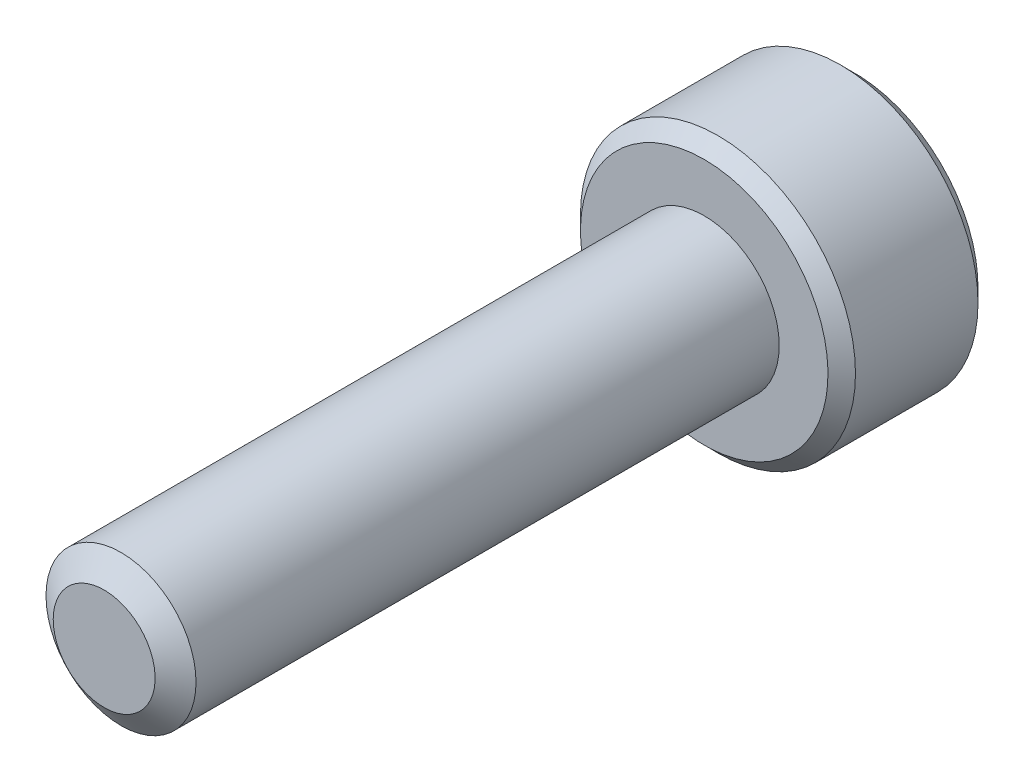
ISO-10303-21;
HEADER;
FILE_DESCRIPTION(('STEP AP214'),'2;1');
FILE_NAME('part.step','',(''),(''),'','','');
FILE_SCHEMA(('AUTOMOTIVE_DESIGN { 1 0 10303 214 1 1 1 1 }'));
ENDSEC;
DATA;
#1=APPLICATION_CONTEXT('core data for automotive mechanical design processes');
#2=APPLICATION_PROTOCOL_DEFINITION('international standard','automotive_design',2000,#1);
#3=PRODUCT_CONTEXT('',#1,'mechanical');
#4=PRODUCT('Part','Part','',(#3));
#5=PRODUCT_RELATED_PRODUCT_CATEGORY('part','',(#4));
#6=PRODUCT_DEFINITION_FORMATION('','',#4);
#7=PRODUCT_DEFINITION_CONTEXT('part definition',#1,'design');
#8=PRODUCT_DEFINITION('design','',#6,#7);
#9=PRODUCT_DEFINITION_SHAPE('','',#8);
#10=(LENGTH_UNIT() NAMED_UNIT(*) SI_UNIT(.MILLI.,.METRE.));
#11=(NAMED_UNIT(*) PLANE_ANGLE_UNIT() SI_UNIT($,.RADIAN.));
#12=(NAMED_UNIT(*) SI_UNIT($,.STERADIAN.) SOLID_ANGLE_UNIT());
#13=UNCERTAINTY_MEASURE_WITH_UNIT(LENGTH_MEASURE(1.E-05),#10,'distance_accuracy_value','');
#14=(GEOMETRIC_REPRESENTATION_CONTEXT(3) GLOBAL_UNCERTAINTY_ASSIGNED_CONTEXT((#13)) GLOBAL_UNIT_ASSIGNED_CONTEXT((#10,
#11,#12)) REPRESENTATION_CONTEXT('',''));
#15=CARTESIAN_POINT('',(0.,0.,0.));
#16=DIRECTION('',(0.,0.,1.));
#17=DIRECTION('',(1.,0.,0.));
#18=AXIS2_PLACEMENT_3D('',#15,#16,#17);
#19=CARTESIAN_POINT('',(0.,-1.44337567297406,-13.125));
#20=DIRECTION('',(-0.5,-0.866025403784439,0.));
#21=DIRECTION('',(0.866025403784439,-0.5,0.));
#22=AXIS2_PLACEMENT_3D('',#19,#20,#21);
#23=PLANE('',#22);
#24=CARTESIAN_POINT('',(-1.24999999999627,-0.72168783648918,-14.999999999981));
#25=CARTESIAN_POINT('',(-1.20703689149248,-0.746492598749065,-14.9752190396993));
#26=CARTESIAN_POINT('',(-1.16335543595108,-0.771712098864492,-14.9518937494442));
#27=CARTESIAN_POINT('',(-1.07428446543387,-0.823137247669585,-14.9091861388918));
#28=CARTESIAN_POINT('',(-1.02888648443279,-0.849347784221223,-14.8898275733312));
#29=CARTESIAN_POINT('',(-0.937343688520415,-0.902200042083602,-14.8566662158854));
#30=CARTESIAN_POINT('',(-0.891222174140267,-0.928828310826413,-14.842780096756));
#31=CARTESIAN_POINT('',(-0.797964038890614,-0.982670920316923,-14.8213859017727));
#32=CARTESIAN_POINT('',(-0.750830264933154,-1.00988361739919,-14.8138618618945));
#33=CARTESIAN_POINT('',(-0.669590913521566,-1.05678717880546,-14.8070728277693));
#34=CARTESIAN_POINT('',(-0.63559017798413,-1.07641751262064,-14.8060681886278));
#35=CARTESIAN_POINT('',(-0.567648554675158,-1.11564362712726,-14.8077634951943));
#36=CARTESIAN_POINT('',(-0.533707681781919,-1.1352393992287,-14.8104642592347));
#37=CARTESIAN_POINT('',(-0.466153619735435,-1.17424175513609,-14.8194142483181));
#38=CARTESIAN_POINT('',(-0.432540764897116,-1.19364814592522,-14.8256667730304));
#39=CARTESIAN_POINT('',(-0.365876260757414,-1.23213691533567,-14.8413835392187));
#40=CARTESIAN_POINT('',(-0.332824858668238,-1.25121915122895,-14.8508491588316));
#41=CARTESIAN_POINT('',(-0.248213569936095,-1.30006950155494,-14.878928331553));
#42=CARTESIAN_POINT('',(-0.19718612443264,-1.32953021095242,-14.8996493450363));
#43=CARTESIAN_POINT('',(-0.0971276056236898,-1.38729902372148,-14.9463235057915));
#44=CARTESIAN_POINT('',(-0.0480906425404536,-1.41561052755783,-14.9722596212031));
#45=CARTESIAN_POINT('',(-3.72296963039514E-12,-1.44337567297191,-14.999999999981));
#46=B_SPLINE_CURVE_WITH_KNOTS('',3,(#24,#25,#26,#27,#28,#29,#30,#31,#32,#33,#34,#35,#36,#37,#38,
#39,#40,#41,#42,#43,#44,#45),.UNSPECIFIED.,.F.,.F.,(4,2,2,2,2,2,2,2,2,2,4),(0.,
0.166478683224832,0.333926926830781,0.498716658515403,0.663091654624535,0.780745575556477,
0.898425484349478,1.01621489976821,1.13405490052235,1.32111591640894,1.50757565757659),.UNSPECIFIED.);
#47=CARTESIAN_POINT('',(-1.24999999995354,-0.721687836511705,-14.9999999999553));
#48=VERTEX_POINT('',#47);
#49=CARTESIAN_POINT('',(4.46040180868087E-11,-1.44337567294616,-14.9999999999553));
#50=VERTEX_POINT('',#49);
#51=EDGE_CURVE('E21',#48,#50,#46,.T.);
#52=ORIENTED_EDGE('',*,*,#51,.F.);
#53=DIRECTION('',(0.,0.,1.));
#54=VECTOR('',#53,1.);
#55=CARTESIAN_POINT('',(-1.25,-0.721687836487033,-13.125));
#56=LINE('',#55,#54);
#57=CARTESIAN_POINT('',(-1.25,-0.721687836487032,-13.125));
#58=VERTEX_POINT('',#57);
#59=EDGE_CURVE('E104',#48,#58,#56,.T.);
#60=ORIENTED_EDGE('',*,*,#59,.T.);
#61=DIRECTION('',(0.866025403784439,-0.5,0.));
#62=VECTOR('',#61,1.);
#63=CARTESIAN_POINT('',(0.,-1.44337567297406,-13.125));
#64=LINE('',#63,#62);
#65=CARTESIAN_POINT('',(0.,-1.44337567297406,-13.125));
#66=VERTEX_POINT('',#65);
#67=EDGE_CURVE('E77',#66,#58,#64,.F.);
#68=ORIENTED_EDGE('',*,*,#67,.F.);
#69=DIRECTION('',(0.,0.,1.));
#70=VECTOR('',#69,1.);
#71=CARTESIAN_POINT('',(0.,-1.44337567297406,-13.125));
#72=LINE('',#71,#70);
#73=EDGE_CURVE('E76',#66,#50,#72,.F.);
#74=ORIENTED_EDGE('',*,*,#73,.T.);
#75=EDGE_LOOP('',(#52,#60,#68,#74));
#76=FACE_BOUND('',#75,.T.);
#77=ADVANCED_FACE('F17',(#76),#23,.F.);
#78=CARTESIAN_POINT('',(1.25,-0.721687836487032,-13.125));
#79=DIRECTION('',(0.5,-0.866025403784439,0.));
#80=DIRECTION('',(0.866025403784439,0.5,0.));
#81=AXIS2_PLACEMENT_3D('',#78,#79,#80);
#82=PLANE('',#81);
#83=CARTESIAN_POINT('',(3.72753063158377E-12,-1.44337567297191,-14.999999999981));
#84=CARTESIAN_POINT('',(0.0429631085075158,-1.41857091071203,-14.9752190396993));
#85=CARTESIAN_POINT('',(0.0866445640489239,-1.3933514105966,-14.9518937494442));
#86=CARTESIAN_POINT('',(0.175715534566134,-1.34192626179151,-14.9091861388918));
#87=CARTESIAN_POINT('',(0.221113515567213,-1.31571572523987,-14.8898275733312));
#88=CARTESIAN_POINT('',(0.312656311479583,-1.26286346737749,-14.8566662158854));
#89=CARTESIAN_POINT('',(0.35877782585973,-1.23623519863468,-14.842780096756));
#90=CARTESIAN_POINT('',(0.452035961109383,-1.18239258914417,-14.8213859017727));
#91=CARTESIAN_POINT('',(0.499169735066843,-1.15517989206191,-14.8138618618945));
#92=CARTESIAN_POINT('',(0.580409086478431,-1.10827633065564,-14.8070728277693));
#93=CARTESIAN_POINT('',(0.614409822015867,-1.08864599684045,-14.8060681886278));
#94=CARTESIAN_POINT('',(0.682351445324839,-1.04941988233384,-14.8077634951944));
#95=CARTESIAN_POINT('',(0.716292318218078,-1.0298241102324,-14.8104642592347));
#96=CARTESIAN_POINT('',(0.783846380264561,-0.990821754325006,-14.8194142483181));
#97=CARTESIAN_POINT('',(0.817459235102881,-0.97141536353587,-14.8256667730304));
#98=CARTESIAN_POINT('',(0.884123739242583,-0.93292659412542,-14.8413835392187));
#99=CARTESIAN_POINT('',(0.917175141331758,-0.91384435823214,-14.8508491588316));
#100=CARTESIAN_POINT('',(1.0017864300639,-0.864994007906156,-14.878928331553));
#101=CARTESIAN_POINT('',(1.05281387556736,-0.835533298508677,-14.8996493450363));
#102=CARTESIAN_POINT('',(1.15287239437631,-0.777764485739615,-14.9463235057915));
#103=CARTESIAN_POINT('',(1.20190935745954,-0.749452981903267,-14.9722596212031));
#104=CARTESIAN_POINT('',(1.24999999999627,-0.721687836489183,-14.999999999981));
#105=B_SPLINE_CURVE_WITH_KNOTS('',3,(#83,#84,#85,#86,#87,#88,#89,#90,#91,#92,#93,#94,#95,#96,
#97,#98,#99,#100,#101,#102,#103,#104),.UNSPECIFIED.,.F.,.F.,(4,2,2,2,2,2,2,2,2,2,4),(0.,
0.166478683224831,0.333926926830778,0.498716658515397,0.663091654624529,0.780745575556471,
0.898425484349472,1.01621489976821,1.13405490052234,1.32111591640894,1.50757565757658),.UNSPECIFIED.);
#106=CARTESIAN_POINT('',(1.24999999999814,-0.721687836434454,-14.9999999999553));
#107=VERTEX_POINT('',#106);
#108=EDGE_CURVE('E84',#50,#107,#105,.T.);
#109=ORIENTED_EDGE('',*,*,#108,.F.);
#110=ORIENTED_EDGE('',*,*,#73,.F.);
#111=DIRECTION('',(-0.86602540378444,-0.499999999999998,0.));
#112=VECTOR('',#111,1.);
#113=CARTESIAN_POINT('',(1.25,-0.721687836487032,-13.125));
#114=LINE('',#113,#112);
#115=CARTESIAN_POINT('',(1.25,-0.721687836487032,-13.125));
#116=VERTEX_POINT('',#115);
#117=EDGE_CURVE('E272',#116,#66,#114,.T.);
#118=ORIENTED_EDGE('',*,*,#117,.F.);
#119=DIRECTION('',(0.,0.,-1.));
#120=VECTOR('',#119,1.);
#121=CARTESIAN_POINT('',(1.25,-0.721687836487032,-13.125));
#122=LINE('',#121,#120);
#123=EDGE_CURVE('E103',#116,#107,#122,.T.);
#124=ORIENTED_EDGE('',*,*,#123,.T.);
#125=EDGE_LOOP('',(#109,#110,#118,#124));
#126=FACE_BOUND('',#125,.T.);
#127=ADVANCED_FACE('F101',(#126),#82,.F.);
#128=CARTESIAN_POINT('',(-1.25,-0.721687836487033,-13.125));
#129=DIRECTION('',(-1.,0.,0.));
#130=DIRECTION('',(0.,-1.,0.));
#131=AXIS2_PLACEMENT_3D('',#128,#129,#130);
#132=PLANE('',#131);
#133=CARTESIAN_POINT('',(-1.25,0.72168783648273,-14.999999999981));
#134=CARTESIAN_POINT('',(-1.25,0.67207831196296,-14.9752190396993));
#135=CARTESIAN_POINT('',(-1.25,0.621639311732107,-14.9518937494442));
#136=CARTESIAN_POINT('',(-1.25,0.518789014121922,-14.9091861388918));
#137=CARTESIAN_POINT('',(-1.25,0.466367941018644,-14.8898275733312));
#138=CARTESIAN_POINT('',(-1.25,0.360663425293887,-14.8566662158854));
#139=CARTESIAN_POINT('',(-1.25,0.307406887808264,-14.842780096756));
#140=CARTESIAN_POINT('',(-1.25,0.199721668827244,-14.8213859017727));
#141=CARTESIAN_POINT('',(-1.25,0.14529627466272,-14.8138618618945));
#142=CARTESIAN_POINT('',(-1.25,0.0514891518501774,-14.8070728277693));
#143=CARTESIAN_POINT('',(-1.25,0.0122284842198093,-14.8060681886278));
#144=CARTESIAN_POINT('',(-1.25,-0.0662237447934208,-14.8077634951944));
#145=CARTESIAN_POINT('',(-1.25,-0.105415288996306,-14.8104642592347));
#146=CARTESIAN_POINT('',(-1.25,-0.183420000811086,-14.8194142483181));
#147=CARTESIAN_POINT('',(-1.25,-0.222232782389357,-14.8256667730304));
#148=CARTESIAN_POINT('',(-1.25,-0.299210321210257,-14.8413835392187));
#149=CARTESIAN_POINT('',(-1.25,-0.337374792996817,-14.8508491588316));
#150=CARTESIAN_POINT('',(-1.25,-0.435075493648785,-14.8789283315531));
#151=CARTESIAN_POINT('',(-1.25,-0.493996912443743,-14.8996493450363));
#152=CARTESIAN_POINT('',(-1.25,-0.609534537981868,-14.9463235057915));
#153=CARTESIAN_POINT('',(-1.25,-0.666157545654563,-14.9722596212031));
#154=CARTESIAN_POINT('',(-1.25,-0.72168783648273,-14.999999999981));
#155=B_SPLINE_CURVE_WITH_KNOTS('',3,(#133,#134,#135,#136,#137,#138,#139,#140,#141,#142,#143,
#144,#145,#146,#147,#148,#149,#150,#151,#152,#153,#154),.UNSPECIFIED.,.F.,.F.,(4,2,2,2,2,2,2,2,
2,2,4),(0.,0.16647868322483,0.333926926830779,0.4987166585154,0.663091654624533,
0.780745575556475,0.898425484349476,1.01621489976821,1.13405490052235,1.32111591640894,
1.50757565757658),.UNSPECIFIED.);
#156=CARTESIAN_POINT('',(-1.24999999999814,0.721687836434454,-14.9999999999553));
#157=VERTEX_POINT('',#156);
#158=EDGE_CURVE('E61',#157,#48,#155,.T.);
#159=ORIENTED_EDGE('',*,*,#158,.F.);
#160=DIRECTION('',(0.,0.,1.));
#161=VECTOR('',#160,1.);
#162=CARTESIAN_POINT('',(-1.25,0.721687836487032,-13.125));
#163=LINE('',#162,#161);
#164=CARTESIAN_POINT('',(-1.25,0.721687836487032,-13.125));
#165=VERTEX_POINT('',#164);
#166=EDGE_CURVE('E249',#157,#165,#163,.T.);
#167=ORIENTED_EDGE('',*,*,#166,.T.);
#168=DIRECTION('',(0.,1.,0.));
#169=VECTOR('',#168,1.);
#170=CARTESIAN_POINT('',(-1.25,2.1650635094611,-13.125));
#171=LINE('',#170,#169);
#172=EDGE_CURVE('E268',#58,#165,#171,.T.);
#173=ORIENTED_EDGE('',*,*,#172,.F.);
#174=ORIENTED_EDGE('',*,*,#59,.F.);
#175=EDGE_LOOP('',(#159,#167,#173,#174));
#176=FACE_BOUND('',#175,.T.);
#177=ADVANCED_FACE('F122',(#176),#132,.F.);
#178=CARTESIAN_POINT('',(1.25,2.1650635094611,-13.125));
#179=DIRECTION('',(0.,0.,-1.));
#180=DIRECTION('',(-1.,0.,0.));
#181=AXIS2_PLACEMENT_3D('',#178,#179,#180);
#182=PLANE('',#181);
#183=ORIENTED_EDGE('',*,*,#67,.T.);
#184=ORIENTED_EDGE('',*,*,#172,.T.);
#185=DIRECTION('',(-0.866025403784439,-0.5,0.));
#186=VECTOR('',#185,1.);
#187=CARTESIAN_POINT('',(-1.25,0.721687836487032,-13.125));
#188=LINE('',#187,#186);
#189=CARTESIAN_POINT('',(0.,1.44337567297406,-13.125));
#190=VERTEX_POINT('',#189);
#191=EDGE_CURVE('E144',#165,#190,#188,.F.);
#192=ORIENTED_EDGE('',*,*,#191,.T.);
#193=DIRECTION('',(-0.866025403784439,0.5,0.));
#194=VECTOR('',#193,1.);
#195=CARTESIAN_POINT('',(0.,1.44337567297406,-13.125));
#196=LINE('',#195,#194);
#197=CARTESIAN_POINT('',(1.25,0.721687836487029,-13.125));
#198=VERTEX_POINT('',#197);
#199=EDGE_CURVE('E246',#190,#198,#196,.F.);
#200=ORIENTED_EDGE('',*,*,#199,.T.);
#201=DIRECTION('',(0.,1.,0.));
#202=VECTOR('',#201,1.);
#203=CARTESIAN_POINT('',(1.25,0.721687836487032,-13.125));
#204=LINE('',#203,#202);
#205=EDGE_CURVE('E263',#198,#116,#204,.F.);
#206=ORIENTED_EDGE('',*,*,#205,.T.);
#207=ORIENTED_EDGE('',*,*,#117,.T.);
#208=EDGE_LOOP('',(#183,#184,#192,#200,#206,#207));
#209=FACE_BOUND('',#208,.T.);
#210=ADVANCED_FACE('F126',(#209),#182,.T.);
#211=CARTESIAN_POINT('',(1.25,0.721687836487032,-13.125));
#212=DIRECTION('',(1.,0.,0.));
#213=DIRECTION('',(0.,0.,-1.));
#214=AXIS2_PLACEMENT_3D('',#211,#212,#213);
#215=PLANE('',#214);
#216=CARTESIAN_POINT('',(1.25,-0.721687836482729,-14.999999999981));
#217=CARTESIAN_POINT('',(1.25,-0.672078311962964,-14.9752190396993));
#218=CARTESIAN_POINT('',(1.25,-0.621639311732115,-14.9518937494442));
#219=CARTESIAN_POINT('',(1.25,-0.51878901412194,-14.9091861388919));
#220=CARTESIAN_POINT('',(1.25,-0.466367941018668,-14.8898275733312));
#221=CARTESIAN_POINT('',(1.25,-0.360663425293912,-14.8566662158855));
#222=CARTESIAN_POINT('',(1.25,-0.307406887808284,-14.842780096756));
#223=CARTESIAN_POINT('',(1.25,-0.199721668827255,-14.8213859017727));
#224=CARTESIAN_POINT('',(1.25,-0.145296274662725,-14.8138618618945));
#225=CARTESIAN_POINT('',(1.25,-0.0514891518501756,-14.8070728277693));
#226=CARTESIAN_POINT('',(1.25,-0.0122284842198057,-14.8060681886278));
#227=CARTESIAN_POINT('',(1.25,0.066223744793428,-14.8077634951944));
#228=CARTESIAN_POINT('',(1.25,0.105415288996315,-14.8104642592347));
#229=CARTESIAN_POINT('',(1.25,0.183420000811095,-14.8194142483181));
#230=CARTESIAN_POINT('',(1.25,0.222232782389364,-14.8256667730304));
#231=CARTESIAN_POINT('',(1.25,0.299210321210261,-14.8413835392187));
#232=CARTESIAN_POINT('',(1.25,0.337374792996818,-14.8508491588316));
#233=CARTESIAN_POINT('',(1.25,0.435075493647794,-14.8789283315528));
#234=CARTESIAN_POINT('',(1.25,0.493996912441795,-14.8996493450356));
#235=CARTESIAN_POINT('',(1.25,0.60953453797808,-14.9463235057899));
#236=CARTESIAN_POINT('',(1.25,0.666157545649893,-14.9722596212009));
#237=CARTESIAN_POINT('',(1.25,0.721687836477212,-14.9999999999783));
#238=B_SPLINE_CURVE_WITH_KNOTS('',3,(#216,#217,#218,#219,#220,#221,#222,#223,#224,#225,#226,
#227,#228,#229,#230,#231,#232,#233,#234,#235,#236,#237),.UNSPECIFIED.,.F.,.F.,(4,2,2,2,2,2,2,2,
2,2,4),(0.,0.166478683224815,0.333926926830747,0.498716658515385,0.663091654624532,
0.78074557555648,0.898425484349487,1.01621489976822,1.13405490052235,1.32111591640585,
1.50757565757042),.UNSPECIFIED.);
#239=CARTESIAN_POINT('',(1.24999999997677,0.721687836473617,-14.9999999999563));
#240=VERTEX_POINT('',#239);
#241=EDGE_CURVE('E40',#107,#240,#238,.T.);
#242=ORIENTED_EDGE('',*,*,#241,.F.);
#243=ORIENTED_EDGE('',*,*,#123,.F.);
#244=ORIENTED_EDGE('',*,*,#205,.F.);
#245=DIRECTION('',(0.,0.,1.));
#246=VECTOR('',#245,1.);
#247=CARTESIAN_POINT('',(1.25,0.721687836487029,-13.125));
#248=LINE('',#247,#246);
#249=EDGE_CURVE('E242',#198,#240,#248,.F.);
#250=ORIENTED_EDGE('',*,*,#249,.T.);
#251=EDGE_LOOP('',(#242,#243,#244,#250));
#252=FACE_BOUND('',#251,.T.);
#253=ADVANCED_FACE('F130',(#252),#215,.F.);
#254=CARTESIAN_POINT('',(-1.25,0.721687836487032,-13.125));
#255=DIRECTION('',(-0.5,0.866025403784439,0.));
#256=DIRECTION('',(-0.866025403784439,-0.5,0.));
#257=AXIS2_PLACEMENT_3D('',#254,#255,#256);
#258=PLANE('',#257);
#259=CARTESIAN_POINT('',(-8.50361731084986E-12,1.44337567296915,-14.9999999999783));
#260=CARTESIAN_POINT('',(-0.0429631085120076,1.41857091070943,-14.9752190396968));
#261=CARTESIAN_POINT('',(-0.0866445640531241,1.39335141059417,-14.9518937494421));
#262=CARTESIAN_POINT('',(-0.175715534569723,1.34192626178944,-14.9091861388903));
#263=CARTESIAN_POINT('',(-0.221113515570482,1.31571572523798,-14.8898275733298));
#264=CARTESIAN_POINT('',(-0.312656311482196,1.26286346737598,-14.8566662158846));
#265=CARTESIAN_POINT('',(-0.358777825862007,1.23623519863337,-14.8427800967554));
#266=CARTESIAN_POINT('',(-0.452035961110966,1.18239258914326,-14.8213859017724));
#267=CARTESIAN_POINT('',(-0.499169735068068,1.1551798920612,-14.8138618618944));
#268=CARTESIAN_POINT('',(-0.580409086479278,1.10827633065515,-14.8070728277692));
#269=CARTESIAN_POINT('',(-0.614409822016699,1.08864599683997,-14.8060681886278));
#270=CARTESIAN_POINT('',(-0.682351445325637,1.04941988233338,-14.8077634951944));
#271=CARTESIAN_POINT('',(-0.716292318218859,1.02982411023194,-14.8104642592348));
#272=CARTESIAN_POINT('',(-0.783846380265307,0.990821754324576,-14.8194142483182));
#273=CARTESIAN_POINT('',(-0.817459235103609,0.97141536353545,-14.8256667730305));
#274=CARTESIAN_POINT('',(-0.884123739243275,0.932926594125021,-14.8413835392189));
#275=CARTESIAN_POINT('',(-0.917175141332432,0.913844358231751,-14.8508491588318));
#276=CARTESIAN_POINT('',(-1.00178643006444,0.864994007905844,-14.8789283315533));
#277=CARTESIAN_POINT('',(-1.05281387556779,0.835533298508429,-14.8996493450365));
#278=CARTESIAN_POINT('',(-1.15287239437652,0.777764485739493,-14.9463235057916));
#279=CARTESIAN_POINT('',(-1.20190935745965,0.749452981903207,-14.9722596212031));
#280=CARTESIAN_POINT('',(-1.24999999999627,0.721687836489183,-14.999999999981));
#281=B_SPLINE_CURVE_WITH_KNOTS('',3,(#259,#260,#261,#262,#263,#264,#265,#266,#267,#268,#269,
#270,#271,#272,#273,#274,#275,#276,#277,#278,#279,#280),.UNSPECIFIED.,.F.,.F.,(4,2,2,2,2,2,2,2,
2,2,4),(0.,0.166478683223539,0.333926926828167,0.498716658511504,0.663091654619366,
0.780745575551252,0.898425484344197,1.01621489976289,1.13405490051697,1.32111591640318,
1.50757565757042),.UNSPECIFIED.);
#282=CARTESIAN_POINT('',(4.22104474212092E-11,1.44337567294478,-14.9999999999539));
#283=VERTEX_POINT('',#282);
#284=EDGE_CURVE('E145',#283,#157,#281,.T.);
#285=ORIENTED_EDGE('',*,*,#284,.F.);
#286=DIRECTION('',(0.,0.,1.));
#287=VECTOR('',#286,1.);
#288=CARTESIAN_POINT('',(0.,1.44337567297406,-13.125));
#289=LINE('',#288,#287);
#290=EDGE_CURVE('E170',#283,#190,#289,.T.);
#291=ORIENTED_EDGE('',*,*,#290,.T.);
#292=ORIENTED_EDGE('',*,*,#191,.F.);
#293=ORIENTED_EDGE('',*,*,#166,.F.);
#294=EDGE_LOOP('',(#285,#291,#292,#293));
#295=FACE_BOUND('',#294,.T.);
#296=ADVANCED_FACE('F135',(#295),#258,.F.);
#297=CARTESIAN_POINT('',(0.,1.44337567297406,-13.125));
#298=DIRECTION('',(0.5,0.866025403784439,0.));
#299=DIRECTION('',(-0.866025403784439,0.5,0.));
#300=AXIS2_PLACEMENT_3D('',#297,#298,#299);
#301=PLANE('',#300);
#302=CARTESIAN_POINT('',(8.50206164392303E-12,1.44337567296915,-14.9999999999783));
#303=CARTESIAN_POINT('',(0.0429631085120025,1.41857091070943,-14.9752190396968));
#304=CARTESIAN_POINT('',(0.0866445640531149,1.39335141059418,-14.9518937494421));
#305=CARTESIAN_POINT('',(0.175715534569705,1.34192626178944,-14.9091861388903));
#306=CARTESIAN_POINT('',(0.221113515570459,1.31571572523799,-14.8898275733298));
#307=CARTESIAN_POINT('',(0.312656311482172,1.26286346737599,-14.8566662158846));
#308=CARTESIAN_POINT('',(0.358777825861988,1.23623519863337,-14.8427800967554));
#309=CARTESIAN_POINT('',(0.452035961110955,1.18239258914326,-14.8213859017724));
#310=CARTESIAN_POINT('',(0.499169735068062,1.1551798920612,-14.8138618618944));
#311=CARTESIAN_POINT('',(0.580409086479279,1.10827633065514,-14.8070728277692));
#312=CARTESIAN_POINT('',(0.614409822016701,1.08864599683997,-14.8060681886278));
#313=CARTESIAN_POINT('',(0.682351445325642,1.04941988233337,-14.8077634951944));
#314=CARTESIAN_POINT('',(0.716292318218866,1.02982411023194,-14.8104642592348));
#315=CARTESIAN_POINT('',(0.783846380265313,0.990821754324568,-14.8194142483182));
#316=CARTESIAN_POINT('',(0.817459235103614,0.971415363535443,-14.8256667730305));
#317=CARTESIAN_POINT('',(0.884123739243277,0.932926594125016,-14.8413835392189));
#318=CARTESIAN_POINT('',(0.917175141332432,0.913844358231748,-14.8508491588318));
#319=CARTESIAN_POINT('',(1.00178643006358,0.864994007906336,-14.878928331553));
#320=CARTESIAN_POINT('',(1.0528138755661,0.8355332985094,-14.8996493450358));
#321=CARTESIAN_POINT('',(1.15287239437324,0.777764485741383,-14.94632350579));
#322=CARTESIAN_POINT('',(1.2019093574556,0.749452981905539,-14.972259621201));
#323=CARTESIAN_POINT('',(1.2499999999915,0.721687836491939,-14.9999999999783));
#324=B_SPLINE_CURVE_WITH_KNOTS('',3,(#302,#303,#304,#305,#306,#307,#308,#309,#310,#311,#312,
#313,#314,#315,#316,#317,#318,#319,#320,#321,#322,#323),.UNSPECIFIED.,.F.,.F.,(4,2,2,2,2,2,2,2,
2,2,4),(0.,0.166478683223524,0.333926926828135,0.498716658511488,0.663091654619366,
0.780745575551258,0.898425484344208,1.01621489976289,1.13405490051697,1.32111591640009,
1.50757565756426),.UNSPECIFIED.);
#325=EDGE_CURVE('E162',#283,#240,#324,.T.);
#326=ORIENTED_EDGE('',*,*,#325,.T.);
#327=ORIENTED_EDGE('',*,*,#249,.F.);
#328=ORIENTED_EDGE('',*,*,#199,.F.);
#329=ORIENTED_EDGE('',*,*,#290,.F.);
#330=EDGE_LOOP('',(#326,#327,#328,#329));
#331=FACE_BOUND('',#330,.T.);
#332=ADVANCED_FACE('F172',(#331),#301,.F.);
#333=CARTESIAN_POINT('',(0.,0.,-14.9999999998727));
#334=DIRECTION('',(0.,0.,-1.));
#335=DIRECTION('',(-1.,0.,0.));
#336=AXIS2_PLACEMENT_3D('',#333,#334,#335);
#337=CONICAL_SURFACE('',#336,1.44337567286357,0.785398163397448);
#338=ORIENTED_EDGE('',*,*,#284,.T.);
#339=CARTESIAN_POINT('',(0.,0.,-14.9999999999295));
#340=DIRECTION('',(0.,0.,-1.));
#341=DIRECTION('',(-1.,0.,0.));
#342=AXIS2_PLACEMENT_3D('',#339,#340,#341);
#343=CIRCLE('',#342,1.44337567292041);
#344=EDGE_CURVE('E169',#283,#157,#343,.F.);
#345=ORIENTED_EDGE('',*,*,#344,.F.);
#346=EDGE_LOOP('',(#338,#345));
#347=FACE_BOUND('',#346,.T.);
#348=ADVANCED_FACE('F175',(#347),#337,.F.);
#349=CARTESIAN_POINT('',(0.,0.,-14.9999999998727));
#350=DIRECTION('',(0.,0.,-1.));
#351=DIRECTION('',(-1.,0.,0.));
#352=AXIS2_PLACEMENT_3D('',#349,#350,#351);
#353=CONICAL_SURFACE('',#352,1.44337567286357,0.785398163397448);
#354=CARTESIAN_POINT('',(0.,0.,-14.9999999999295));
#355=DIRECTION('',(0.,0.,-1.));
#356=DIRECTION('',(-1.,0.,0.));
#357=AXIS2_PLACEMENT_3D('',#354,#355,#356);
#358=CIRCLE('',#357,1.44337567292041);
#359=EDGE_CURVE('E94',#157,#48,#358,.F.);
#360=ORIENTED_EDGE('',*,*,#359,.F.);
#361=ORIENTED_EDGE('',*,*,#158,.T.);
#362=EDGE_LOOP('',(#360,#361));
#363=FACE_BOUND('',#362,.T.);
#364=ADVANCED_FACE('F179',(#363),#353,.F.);
#365=CARTESIAN_POINT('',(0.,0.,-14.9999999998727));
#366=DIRECTION('',(0.,0.,-1.));
#367=DIRECTION('',(-1.,0.,0.));
#368=AXIS2_PLACEMENT_3D('',#365,#366,#367);
#369=CONICAL_SURFACE('',#368,1.44337567286357,0.785398163397448);
#370=ORIENTED_EDGE('',*,*,#51,.T.);
#371=CARTESIAN_POINT('',(0.,0.,-14.9999999999295));
#372=DIRECTION('',(0.,0.,-1.));
#373=DIRECTION('',(-1.,0.,0.));
#374=AXIS2_PLACEMENT_3D('',#371,#372,#373);
#375=CIRCLE('',#374,1.44337567292041);
#376=EDGE_CURVE('E72',#48,#50,#375,.F.);
#377=ORIENTED_EDGE('',*,*,#376,.F.);
#378=EDGE_LOOP('',(#370,#377));
#379=FACE_BOUND('',#378,.T.);
#380=ADVANCED_FACE('F70',(#379),#369,.F.);
#381=CARTESIAN_POINT('',(0.,0.,-14.9999999998727));
#382=DIRECTION('',(0.,0.,-1.));
#383=DIRECTION('',(-1.,0.,0.));
#384=AXIS2_PLACEMENT_3D('',#381,#382,#383);
#385=CONICAL_SURFACE('',#384,1.44337567286357,0.785398163397448);
#386=ORIENTED_EDGE('',*,*,#108,.T.);
#387=CARTESIAN_POINT('',(0.,0.,-14.9999999999295));
#388=DIRECTION('',(0.,0.,-1.));
#389=DIRECTION('',(-1.,0.,0.));
#390=AXIS2_PLACEMENT_3D('',#387,#388,#389);
#391=CIRCLE('',#390,1.44337567292041);
#392=EDGE_CURVE('E92',#50,#107,#391,.F.);
#393=ORIENTED_EDGE('',*,*,#392,.F.);
#394=EDGE_LOOP('',(#386,#393));
#395=FACE_BOUND('',#394,.T.);
#396=ADVANCED_FACE('F97',(#395),#385,.F.);
#397=CARTESIAN_POINT('',(0.,0.,-14.9999999998727));
#398=DIRECTION('',(0.,0.,-1.));
#399=DIRECTION('',(-1.,0.,0.));
#400=AXIS2_PLACEMENT_3D('',#397,#398,#399);
#401=CONICAL_SURFACE('',#400,1.44337567286357,0.785398163397448);
#402=ORIENTED_EDGE('',*,*,#241,.T.);
#403=CARTESIAN_POINT('',(0.,0.,-14.9999999999295));
#404=DIRECTION('',(0.,0.,-1.));
#405=DIRECTION('',(-1.,0.,0.));
#406=AXIS2_PLACEMENT_3D('',#403,#404,#405);
#407=CIRCLE('',#406,1.44337567292041);
#408=EDGE_CURVE('E99',#107,#240,#407,.F.);
#409=ORIENTED_EDGE('',*,*,#408,.F.);
#410=EDGE_LOOP('',(#402,#409));
#411=FACE_BOUND('',#410,.T.);
#412=ADVANCED_FACE('F152',(#411),#401,.F.);
#413=CARTESIAN_POINT('',(0.,0.,-14.9999999998727));
#414=DIRECTION('',(0.,0.,-1.));
#415=DIRECTION('',(-1.,0.,0.));
#416=AXIS2_PLACEMENT_3D('',#413,#414,#415);
#417=CONICAL_SURFACE('',#416,1.44337567286357,0.785398163397448);
#418=ORIENTED_EDGE('',*,*,#325,.F.);
#419=CARTESIAN_POINT('',(0.,0.,-14.9999999999295));
#420=DIRECTION('',(0.,0.,-1.));
#421=DIRECTION('',(-1.,0.,0.));
#422=AXIS2_PLACEMENT_3D('',#419,#420,#421);
#423=CIRCLE('',#422,1.44337567292041);
#424=EDGE_CURVE('E234',#240,#283,#423,.F.);
#425=ORIENTED_EDGE('',*,*,#424,.F.);
#426=EDGE_LOOP('',(#418,#425));
#427=FACE_BOUND('',#426,.T.);
#428=ADVANCED_FACE('F156',(#427),#417,.F.);
#429=CARTESIAN_POINT('',(0.,0.,-15.));
#430=DIRECTION('',(0.,0.,-1.));
#431=DIRECTION('',(-1.,0.,0.));
#432=AXIS2_PLACEMENT_3D('',#429,#430,#431);
#433=PLANE('',#432);
#434=ORIENTED_EDGE('',*,*,#408,.T.);
#435=ORIENTED_EDGE('',*,*,#424,.T.);
#436=ORIENTED_EDGE('',*,*,#344,.T.);
#437=ORIENTED_EDGE('',*,*,#359,.T.);
#438=ORIENTED_EDGE('',*,*,#376,.T.);
#439=ORIENTED_EDGE('',*,*,#392,.T.);
#440=EDGE_LOOP('',(#434,#435,#436,#437,#438,#439));
#441=FACE_BOUND('',#440,.T.);
#442=CARTESIAN_POINT('',(0.,0.,-14.9999999999864));
#443=DIRECTION('',(0.,0.,1.));
#444=DIRECTION('',(0.,-1.,0.));
#445=AXIS2_PLACEMENT_3D('',#442,#443,#444);
#446=CIRCLE('',#445,2.47500000006085);
#447=CARTESIAN_POINT('',(0.,-2.47500000006085,-14.9999999999864));
#448=VERTEX_POINT('',#447);
#449=EDGE_CURVE('E225',#448,#448,#446,.T.);
#450=ORIENTED_EDGE('',*,*,#449,.F.);
#451=EDGE_LOOP('',(#450));
#452=FACE_BOUND('',#451,.T.);
#453=ADVANCED_FACE('F90',(#441,#452),#433,.T.);
#454=CARTESIAN_POINT('',(0.,0.,-14.7249999999417));
#455=DIRECTION('',(0.,0.,1.));
#456=DIRECTION('',(0.,-1.,0.));
#457=AXIS2_PLACEMENT_3D('',#454,#455,#456);
#458=CONICAL_SURFACE('',#457,2.75000000016234,0.7853981635008);
#459=ORIENTED_EDGE('',*,*,#449,.T.);
#460=EDGE_LOOP('',(#459));
#461=FACE_BOUND('',#460,.T.);
#462=CARTESIAN_POINT('',(0.,0.,-14.725));
#463=DIRECTION('',(0.,0.,1.));
#464=DIRECTION('',(1.,0.,0.));
#465=AXIS2_PLACEMENT_3D('',#462,#463,#464);
#466=CIRCLE('',#465,2.75);
#467=CARTESIAN_POINT('',(2.75,0.,-14.725));
#468=VERTEX_POINT('',#467);
#469=EDGE_CURVE('E228',#468,#468,#466,.T.);
#470=ORIENTED_EDGE('',*,*,#469,.F.);
#471=EDGE_LOOP('',(#470));
#472=FACE_BOUND('',#471,.T.);
#473=ADVANCED_FACE('F215',(#461,#472),#458,.T.);
#474=CARTESIAN_POINT('',(0.,0.,-15.));
#475=DIRECTION('',(0.,0.,1.));
#476=DIRECTION('',(1.,0.,0.));
#477=AXIS2_PLACEMENT_3D('',#474,#475,#476);
#478=CYLINDRICAL_SURFACE('',#477,2.75);
#479=ORIENTED_EDGE('',*,*,#469,.T.);
#480=EDGE_LOOP('',(#479));
#481=FACE_BOUND('',#480,.T.);
#482=CARTESIAN_POINT('',(0.,0.,-12.2749999999883));
#483=DIRECTION('',(0.,0.,-1.));
#484=DIRECTION('',(-1.,0.,0.));
#485=AXIS2_PLACEMENT_3D('',#482,#483,#484);
#486=CIRCLE('',#485,2.74999999999181);
#487=CARTESIAN_POINT('',(-2.74999999999181,0.,-12.2749999999883));
#488=VERTEX_POINT('',#487);
#489=EDGE_CURVE('E229',#488,#488,#486,.F.);
#490=ORIENTED_EDGE('',*,*,#489,.F.);
#491=EDGE_LOOP('',(#490));
#492=FACE_BOUND('',#491,.T.);
#493=ADVANCED_FACE('F212',(#481,#492),#478,.T.);
#494=CARTESIAN_POINT('',(0.,0.,0.));
#495=DIRECTION('',(0.,0.,1.));
#496=DIRECTION('',(1.,0.,0.));
#497=AXIS2_PLACEMENT_3D('',#494,#495,#496);
#498=PLANE('',#497);
#499=CARTESIAN_POINT('',(0.,0.,-8.53241630995039E-11));
#500=DIRECTION('',(0.,0.,-1.));
#501=DIRECTION('',(-1.,0.,0.));
#502=AXIS2_PLACEMENT_3D('',#499,#500,#501);
#503=CIRCLE('',#502,1.01866833148279);
#504=CARTESIAN_POINT('',(-1.01866833148279,0.,-8.53241630995039E-11));
#505=VERTEX_POINT('',#504);
#506=EDGE_CURVE('E232',#505,#505,#503,.T.);
#507=ORIENTED_EDGE('',*,*,#506,.F.);
#508=EDGE_LOOP('',(#507));
#509=FACE_BOUND('',#508,.T.);
#510=ADVANCED_FACE('F208',(#509),#498,.T.);
#511=CARTESIAN_POINT('',(0.,0.,-12.2749999999883));
#512=DIRECTION('',(0.,0.,-1.));
#513=DIRECTION('',(0.,1.,0.));
#514=AXIS2_PLACEMENT_3D('',#511,#512,#513);
#515=CONICAL_SURFACE('',#514,2.74999999999181,0.785398163397448);
#516=CARTESIAN_POINT('',(0.,0.,-12.0000000000005));
#517=DIRECTION('',(0.,0.,-1.));
#518=DIRECTION('',(0.,1.,0.));
#519=AXIS2_PLACEMENT_3D('',#516,#517,#518);
#520=CIRCLE('',#519,2.475000000004);
#521=CARTESIAN_POINT('',(0.,2.475000000004,-12.0000000000005));
#522=VERTEX_POINT('',#521);
#523=EDGE_CURVE('E287',#522,#522,#520,.T.);
#524=ORIENTED_EDGE('',*,*,#523,.T.);
#525=EDGE_LOOP('',(#524));
#526=FACE_BOUND('',#525,.T.);
#527=ORIENTED_EDGE('',*,*,#489,.T.);
#528=EDGE_LOOP('',(#527));
#529=FACE_BOUND('',#528,.T.);
#530=ADVANCED_FACE('F204',(#526,#529),#515,.T.);
#531=CARTESIAN_POINT('',(0.,0.,-0.337032062475373));
#532=DIRECTION('',(0.,0.,-1.));
#533=DIRECTION('',(-1.,0.,0.));
#534=AXIS2_PLACEMENT_3D('',#531,#532,#533);
#535=CONICAL_SURFACE('',#534,1.49999999962347,0.959931088626313);
#536=ORIENTED_EDGE('',*,*,#506,.T.);
#537=EDGE_LOOP('',(#536));
#538=FACE_BOUND('',#537,.T.);
#539=CARTESIAN_POINT('',(0.,0.,-0.337032062658145));
#540=DIRECTION('',(0.,0.,1.));
#541=DIRECTION('',(1.,0.,0.));
#542=AXIS2_PLACEMENT_3D('',#539,#540,#541);
#543=CIRCLE('',#542,1.5);
#544=CARTESIAN_POINT('',(1.5,0.,-0.337032062658145));
#545=VERTEX_POINT('',#544);
#546=EDGE_CURVE('E32',#545,#545,#543,.F.);
#547=ORIENTED_EDGE('',*,*,#546,.F.);
#548=EDGE_LOOP('',(#547));
#549=FACE_BOUND('',#548,.T.);
#550=ADVANCED_FACE('F197',(#538,#549),#535,.T.);
#551=CARTESIAN_POINT('',(0.,0.,-12.));
#552=DIRECTION('',(0.,0.,-1.));
#553=DIRECTION('',(-1.,0.,0.));
#554=AXIS2_PLACEMENT_3D('',#551,#552,#553);
#555=PLANE('',#554);
#556=CARTESIAN_POINT('',(0.,0.,-12.));
#557=DIRECTION('',(0.,0.,1.));
#558=DIRECTION('',(1.,0.,0.));
#559=AXIS2_PLACEMENT_3D('',#556,#557,#558);
#560=CIRCLE('',#559,1.5);
#561=CARTESIAN_POINT('',(1.5,0.,-12.));
#562=VERTEX_POINT('',#561);
#563=EDGE_CURVE('E11',#562,#562,#560,.T.);
#564=ORIENTED_EDGE('',*,*,#563,.F.);
#565=EDGE_LOOP('',(#564));
#566=FACE_BOUND('',#565,.T.);
#567=ORIENTED_EDGE('',*,*,#523,.F.);
#568=EDGE_LOOP('',(#567));
#569=FACE_BOUND('',#568,.T.);
#570=ADVANCED_FACE('F191',(#566,#569),#555,.F.);
#571=CARTESIAN_POINT('',(0.,0.,-12.));
#572=DIRECTION('',(0.,0.,1.));
#573=DIRECTION('',(1.,0.,0.));
#574=AXIS2_PLACEMENT_3D('',#571,#572,#573);
#575=CYLINDRICAL_SURFACE('',#574,1.5);
#576=ORIENTED_EDGE('',*,*,#563,.T.);
#577=EDGE_LOOP('',(#576));
#578=FACE_BOUND('',#577,.T.);
#579=ORIENTED_EDGE('',*,*,#546,.T.);
#580=EDGE_LOOP('',(#579));
#581=FACE_BOUND('',#580,.T.);
#582=ADVANCED_FACE('F189',(#578,#581),#575,.T.);
#583=CLOSED_SHELL('',(#77,#127,#177,#210,#253,#296,#332,#348,#364,#380,#396,#412,#428,#453,#473,
#493,#510,#530,#550,#570,#582));
#584=MANIFOLD_SOLID_BREP('B1',#583);
#585=ADVANCED_BREP_SHAPE_REPRESENTATION('',(#18,#584),#14);
#586=SHAPE_DEFINITION_REPRESENTATION(#9,#585);
ENDSEC;
END-ISO-10303-21;
